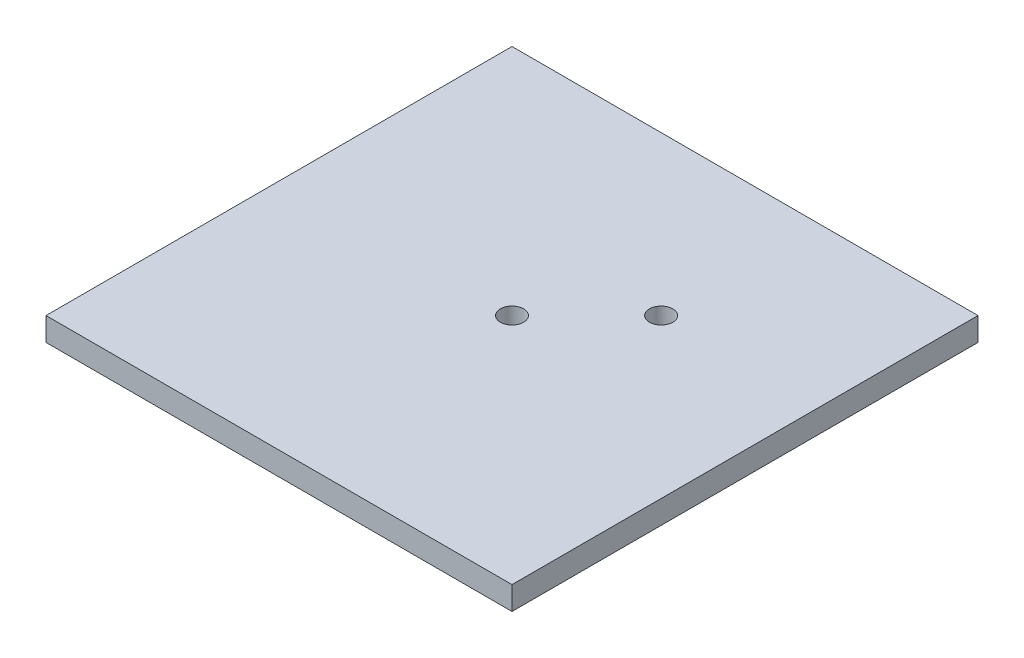
ISO-10303-21;
HEADER;
FILE_DESCRIPTION(('STEP AP214'),'2;1');
FILE_NAME('part.step','',(''),(''),'','','');
FILE_SCHEMA(('AUTOMOTIVE_DESIGN { 1 0 10303 214 1 1 1 1 }'));
ENDSEC;
DATA;
#1=APPLICATION_CONTEXT('core data for automotive mechanical design processes');
#2=APPLICATION_PROTOCOL_DEFINITION('international standard','automotive_design',2000,#1);
#3=PRODUCT_CONTEXT('',#1,'mechanical');
#4=PRODUCT('Part','Part','',(#3));
#5=PRODUCT_RELATED_PRODUCT_CATEGORY('part','',(#4));
#6=PRODUCT_DEFINITION_FORMATION('','',#4);
#7=PRODUCT_DEFINITION_CONTEXT('part definition',#1,'design');
#8=PRODUCT_DEFINITION('design','',#6,#7);
#9=PRODUCT_DEFINITION_SHAPE('','',#8);
#10=(LENGTH_UNIT() NAMED_UNIT(*) SI_UNIT(.MILLI.,.METRE.));
#11=(NAMED_UNIT(*) PLANE_ANGLE_UNIT() SI_UNIT($,.RADIAN.));
#12=(NAMED_UNIT(*) SI_UNIT($,.STERADIAN.) SOLID_ANGLE_UNIT());
#13=UNCERTAINTY_MEASURE_WITH_UNIT(LENGTH_MEASURE(1.E-05),#10,'distance_accuracy_value','');
#14=(GEOMETRIC_REPRESENTATION_CONTEXT(3) GLOBAL_UNCERTAINTY_ASSIGNED_CONTEXT((#13)) GLOBAL_UNIT_ASSIGNED_CONTEXT((#10,
#11,#12)) REPRESENTATION_CONTEXT('',''));
#15=CARTESIAN_POINT('',(0.,0.,0.));
#16=DIRECTION('',(0.,0.,1.));
#17=DIRECTION('',(1.,0.,0.));
#18=AXIS2_PLACEMENT_3D('',#15,#16,#17);
#19=CARTESIAN_POINT('',(0.,5.,0.));
#20=DIRECTION('',(0.,1.,0.));
#21=DIRECTION('',(0.,0.,1.));
#22=AXIS2_PLACEMENT_3D('',#19,#20,#21);
#23=PLANE('',#22);
#24=CARTESIAN_POINT('',(0.,5.,0.));
#25=DIRECTION('',(0.,1.,0.));
#26=DIRECTION('',(0.,0.,1.));
#27=AXIS2_PLACEMENT_3D('',#24,#25,#26);
#28=CIRCLE('',#27,2.5);
#29=CARTESIAN_POINT('',(0.,5.,2.5));
#30=VERTEX_POINT('',#29);
#31=EDGE_CURVE('E100',#30,#30,#28,.T.);
#32=ORIENTED_EDGE('',*,*,#31,.F.);
#33=EDGE_LOOP('',(#32));
#34=FACE_BOUND('',#33,.T.);
#35=DIRECTION('',(0.,0.,1.));
#36=VECTOR('',#35,1.);
#37=CARTESIAN_POINT('',(-50.,5.,50.));
#38=LINE('',#37,#36);
#39=CARTESIAN_POINT('',(-50.,5.,-50.));
#40=VERTEX_POINT('',#39);
#41=CARTESIAN_POINT('',(-50.,5.,50.));
#42=VERTEX_POINT('',#41);
#43=EDGE_CURVE('E85',#40,#42,#38,.T.);
#44=ORIENTED_EDGE('',*,*,#43,.T.);
#45=DIRECTION('',(1.,0.,0.));
#46=VECTOR('',#45,1.);
#47=CARTESIAN_POINT('',(50.,5.,50.));
#48=LINE('',#47,#46);
#49=CARTESIAN_POINT('',(50.,5.,50.));
#50=VERTEX_POINT('',#49);
#51=EDGE_CURVE('E80',#42,#50,#48,.T.);
#52=ORIENTED_EDGE('',*,*,#51,.T.);
#53=DIRECTION('',(0.,0.,-1.));
#54=VECTOR('',#53,1.);
#55=CARTESIAN_POINT('',(50.,5.,50.));
#56=LINE('',#55,#54);
#57=CARTESIAN_POINT('',(50.,5.,-50.));
#58=VERTEX_POINT('',#57);
#59=EDGE_CURVE('E83',#50,#58,#56,.T.);
#60=ORIENTED_EDGE('',*,*,#59,.T.);
#61=DIRECTION('',(-1.,0.,0.));
#62=VECTOR('',#61,1.);
#63=CARTESIAN_POINT('',(50.,5.,-50.));
#64=LINE('',#63,#62);
#65=EDGE_CURVE('E50',#58,#40,#64,.T.);
#66=ORIENTED_EDGE('',*,*,#65,.T.);
#67=EDGE_LOOP('',(#44,#52,#60,#66));
#68=FACE_BOUND('',#67,.T.);
#69=CARTESIAN_POINT('',(16.,5.,-16.));
#70=DIRECTION('',(0.,1.,0.));
#71=DIRECTION('',(0.,0.,1.));
#72=AXIS2_PLACEMENT_3D('',#69,#70,#71);
#73=CIRCLE('',#72,2.5);
#74=CARTESIAN_POINT('',(16.,5.,-13.5));
#75=VERTEX_POINT('',#74);
#76=EDGE_CURVE('E115',#75,#75,#73,.T.);
#77=ORIENTED_EDGE('',*,*,#76,.F.);
#78=EDGE_LOOP('',(#77));
#79=FACE_BOUND('',#78,.T.);
#80=ADVANCED_FACE('F33',(#34,#68,#79),#23,.T.);
#81=CARTESIAN_POINT('',(0.,0.,0.));
#82=DIRECTION('',(0.,1.,0.));
#83=DIRECTION('',(0.,0.,1.));
#84=AXIS2_PLACEMENT_3D('',#81,#82,#83);
#85=PLANE('',#84);
#86=DIRECTION('',(0.,0.,1.));
#87=VECTOR('',#86,1.);
#88=CARTESIAN_POINT('',(-50.,0.,50.));
#89=LINE('',#88,#87);
#90=CARTESIAN_POINT('',(-50.,0.,-50.));
#91=VERTEX_POINT('',#90);
#92=CARTESIAN_POINT('',(-50.,0.,50.));
#93=VERTEX_POINT('',#92);
#94=EDGE_CURVE('E97',#91,#93,#89,.T.);
#95=ORIENTED_EDGE('',*,*,#94,.F.);
#96=DIRECTION('',(-1.,0.,0.));
#97=VECTOR('',#96,1.);
#98=CARTESIAN_POINT('',(50.,0.,-50.));
#99=LINE('',#98,#97);
#100=CARTESIAN_POINT('',(50.,0.,-50.));
#101=VERTEX_POINT('',#100);
#102=EDGE_CURVE('E73',#101,#91,#99,.T.);
#103=ORIENTED_EDGE('',*,*,#102,.F.);
#104=DIRECTION('',(0.,0.,-1.));
#105=VECTOR('',#104,1.);
#106=CARTESIAN_POINT('',(50.,0.,50.));
#107=LINE('',#106,#105);
#108=CARTESIAN_POINT('',(50.,0.,50.));
#109=VERTEX_POINT('',#108);
#110=EDGE_CURVE('E67',#109,#101,#107,.T.);
#111=ORIENTED_EDGE('',*,*,#110,.F.);
#112=DIRECTION('',(1.,0.,0.));
#113=VECTOR('',#112,1.);
#114=CARTESIAN_POINT('',(50.,0.,50.));
#115=LINE('',#114,#113);
#116=EDGE_CURVE('E89',#93,#109,#115,.T.);
#117=ORIENTED_EDGE('',*,*,#116,.F.);
#118=EDGE_LOOP('',(#95,#103,#111,#117));
#119=FACE_BOUND('',#118,.T.);
#120=CARTESIAN_POINT('',(0.,0.,0.));
#121=DIRECTION('',(0.,1.,0.));
#122=DIRECTION('',(0.,0.,1.));
#123=AXIS2_PLACEMENT_3D('',#120,#121,#122);
#124=CIRCLE('',#123,2.5);
#125=CARTESIAN_POINT('',(0.,0.,2.5));
#126=VERTEX_POINT('',#125);
#127=EDGE_CURVE('E112',#126,#126,#124,.T.);
#128=ORIENTED_EDGE('',*,*,#127,.T.);
#129=EDGE_LOOP('',(#128));
#130=FACE_BOUND('',#129,.T.);
#131=CARTESIAN_POINT('',(16.,0.,-16.));
#132=DIRECTION('',(0.,1.,0.));
#133=DIRECTION('',(0.,0.,1.));
#134=AXIS2_PLACEMENT_3D('',#131,#132,#133);
#135=CIRCLE('',#134,2.5);
#136=CARTESIAN_POINT('',(16.,0.,-13.5));
#137=VERTEX_POINT('',#136);
#138=EDGE_CURVE('E118',#137,#137,#135,.T.);
#139=ORIENTED_EDGE('',*,*,#138,.T.);
#140=EDGE_LOOP('',(#139));
#141=FACE_BOUND('',#140,.T.);
#142=ADVANCED_FACE('F108',(#119,#130,#141),#85,.F.);
#143=CARTESIAN_POINT('',(-50.,5.,50.));
#144=DIRECTION('',(1.,0.,0.));
#145=DIRECTION('',(0.,0.,-1.));
#146=AXIS2_PLACEMENT_3D('',#143,#144,#145);
#147=PLANE('',#146);
#148=ORIENTED_EDGE('',*,*,#94,.T.);
#149=DIRECTION('',(0.,-1.,0.));
#150=VECTOR('',#149,1.);
#151=CARTESIAN_POINT('',(-50.,5.,50.));
#152=LINE('',#151,#150);
#153=EDGE_CURVE('E11',#42,#93,#152,.T.);
#154=ORIENTED_EDGE('',*,*,#153,.F.);
#155=ORIENTED_EDGE('',*,*,#43,.F.);
#156=DIRECTION('',(0.,-1.,0.));
#157=VECTOR('',#156,1.);
#158=CARTESIAN_POINT('',(-50.,5.,-50.));
#159=LINE('',#158,#157);
#160=EDGE_CURVE('E93',#40,#91,#159,.T.);
#161=ORIENTED_EDGE('',*,*,#160,.T.);
#162=EDGE_LOOP('',(#148,#154,#155,#161));
#163=FACE_BOUND('',#162,.T.);
#164=ADVANCED_FACE('F35',(#163),#147,.F.);
#165=CARTESIAN_POINT('',(50.,5.,50.));
#166=DIRECTION('',(0.,0.,-1.));
#167=DIRECTION('',(-1.,0.,0.));
#168=AXIS2_PLACEMENT_3D('',#165,#166,#167);
#169=PLANE('',#168);
#170=ORIENTED_EDGE('',*,*,#116,.T.);
#171=DIRECTION('',(0.,-1.,0.));
#172=VECTOR('',#171,1.);
#173=CARTESIAN_POINT('',(50.,5.,50.));
#174=LINE('',#173,#172);
#175=EDGE_CURVE('E42',#50,#109,#174,.T.);
#176=ORIENTED_EDGE('',*,*,#175,.F.);
#177=ORIENTED_EDGE('',*,*,#51,.F.);
#178=ORIENTED_EDGE('',*,*,#153,.T.);
#179=EDGE_LOOP('',(#170,#176,#177,#178));
#180=FACE_BOUND('',#179,.T.);
#181=ADVANCED_FACE('F88',(#180),#169,.F.);
#182=CARTESIAN_POINT('',(50.,5.,50.));
#183=DIRECTION('',(-1.,0.,0.));
#184=DIRECTION('',(0.,0.,1.));
#185=AXIS2_PLACEMENT_3D('',#182,#183,#184);
#186=PLANE('',#185);
#187=ORIENTED_EDGE('',*,*,#110,.T.);
#188=DIRECTION('',(0.,-1.,0.));
#189=VECTOR('',#188,1.);
#190=CARTESIAN_POINT('',(50.,5.,-50.));
#191=LINE('',#190,#189);
#192=EDGE_CURVE('E90',#58,#101,#191,.T.);
#193=ORIENTED_EDGE('',*,*,#192,.F.);
#194=ORIENTED_EDGE('',*,*,#59,.F.);
#195=ORIENTED_EDGE('',*,*,#175,.T.);
#196=EDGE_LOOP('',(#187,#193,#194,#195));
#197=FACE_BOUND('',#196,.T.);
#198=ADVANCED_FACE('F91',(#197),#186,.F.);
#199=CARTESIAN_POINT('',(50.,5.,-50.));
#200=DIRECTION('',(0.,0.,1.));
#201=DIRECTION('',(1.,0.,0.));
#202=AXIS2_PLACEMENT_3D('',#199,#200,#201);
#203=PLANE('',#202);
#204=ORIENTED_EDGE('',*,*,#102,.T.);
#205=ORIENTED_EDGE('',*,*,#160,.F.);
#206=ORIENTED_EDGE('',*,*,#65,.F.);
#207=ORIENTED_EDGE('',*,*,#192,.T.);
#208=EDGE_LOOP('',(#204,#205,#206,#207));
#209=FACE_BOUND('',#208,.T.);
#210=ADVANCED_FACE('F105',(#209),#203,.F.);
#211=CARTESIAN_POINT('',(0.,5.,0.));
#212=DIRECTION('',(0.,-1.,0.));
#213=DIRECTION('',(0.,0.,-1.));
#214=AXIS2_PLACEMENT_3D('',#211,#212,#213);
#215=CYLINDRICAL_SURFACE('',#214,2.5);
#216=ORIENTED_EDGE('',*,*,#31,.T.);
#217=EDGE_LOOP('',(#216));
#218=FACE_BOUND('',#217,.T.);
#219=ORIENTED_EDGE('',*,*,#127,.F.);
#220=EDGE_LOOP('',(#219));
#221=FACE_BOUND('',#220,.T.);
#222=ADVANCED_FACE('F135',(#218,#221),#215,.F.);
#223=CARTESIAN_POINT('',(16.,5.,-16.));
#224=DIRECTION('',(0.,-1.,0.));
#225=DIRECTION('',(0.,0.,-1.));
#226=AXIS2_PLACEMENT_3D('',#223,#224,#225);
#227=CYLINDRICAL_SURFACE('',#226,2.5);
#228=ORIENTED_EDGE('',*,*,#76,.T.);
#229=EDGE_LOOP('',(#228));
#230=FACE_BOUND('',#229,.T.);
#231=ORIENTED_EDGE('',*,*,#138,.F.);
#232=EDGE_LOOP('',(#231));
#233=FACE_BOUND('',#232,.T.);
#234=ADVANCED_FACE('F124',(#230,#233),#227,.F.);
#235=CLOSED_SHELL('',(#80,#142,#164,#181,#198,#210,#222,#234));
#236=MANIFOLD_SOLID_BREP('B2',#235);
#237=ADVANCED_BREP_SHAPE_REPRESENTATION('',(#18,#236),#14);
#238=SHAPE_DEFINITION_REPRESENTATION(#9,#237);
ENDSEC;
END-ISO-10303-21;
